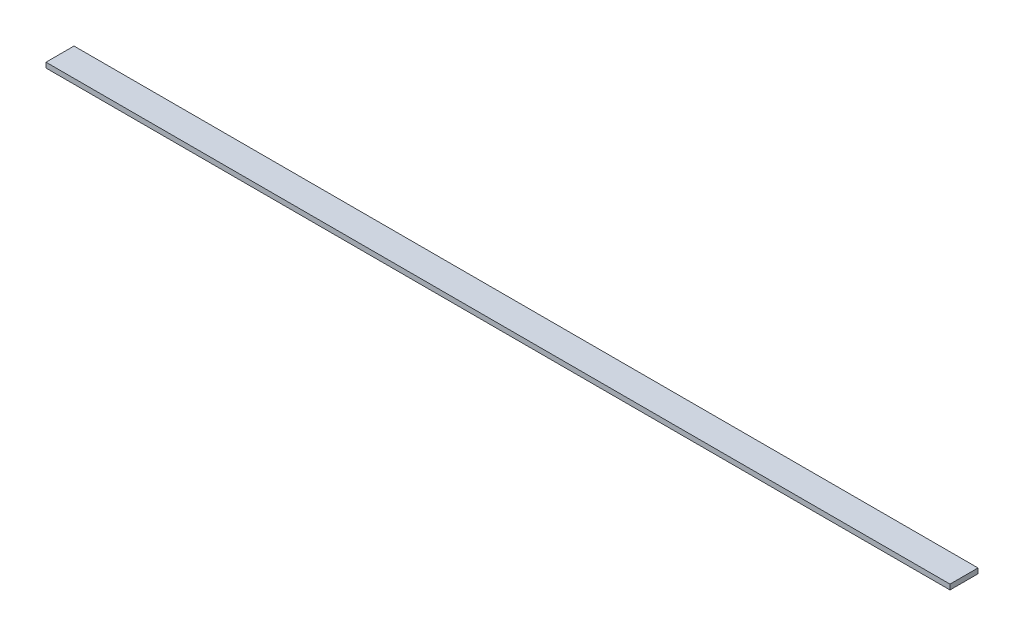
ISO-10303-21;
HEADER;
FILE_DESCRIPTION(('STEP AP214'),'2;1');
FILE_NAME('part.step','',(''),(''),'','','');
FILE_SCHEMA(('AUTOMOTIVE_DESIGN { 1 0 10303 214 1 1 1 1 }'));
ENDSEC;
DATA;
#1=APPLICATION_CONTEXT('core data for automotive mechanical design processes');
#2=APPLICATION_PROTOCOL_DEFINITION('international standard','automotive_design',2000,#1);
#3=PRODUCT_CONTEXT('',#1,'mechanical');
#4=PRODUCT('Part','Part','',(#3));
#5=PRODUCT_RELATED_PRODUCT_CATEGORY('part','',(#4));
#6=PRODUCT_DEFINITION_FORMATION('','',#4);
#7=PRODUCT_DEFINITION_CONTEXT('part definition',#1,'design');
#8=PRODUCT_DEFINITION('design','',#6,#7);
#9=PRODUCT_DEFINITION_SHAPE('','',#8);
#10=(LENGTH_UNIT() NAMED_UNIT(*) SI_UNIT(.MILLI.,.METRE.));
#11=(NAMED_UNIT(*) PLANE_ANGLE_UNIT() SI_UNIT($,.RADIAN.));
#12=(NAMED_UNIT(*) SI_UNIT($,.STERADIAN.) SOLID_ANGLE_UNIT());
#13=UNCERTAINTY_MEASURE_WITH_UNIT(LENGTH_MEASURE(1.E-05),#10,'distance_accuracy_value','');
#14=(GEOMETRIC_REPRESENTATION_CONTEXT(3) GLOBAL_UNCERTAINTY_ASSIGNED_CONTEXT((#13)) GLOBAL_UNIT_ASSIGNED_CONTEXT((#10,
#11,#12)) REPRESENTATION_CONTEXT('',''));
#15=CARTESIAN_POINT('',(0.,0.,0.));
#16=DIRECTION('',(0.,0.,1.));
#17=DIRECTION('',(1.,0.,0.));
#18=AXIS2_PLACEMENT_3D('',#15,#16,#17);
#19=CARTESIAN_POINT('',(0.,25.4,0.));
#20=DIRECTION('',(1.,0.,0.));
#21=DIRECTION('',(0.,0.,-1.));
#22=AXIS2_PLACEMENT_3D('',#19,#20,#21);
#23=PLANE('',#22);
#24=DIRECTION('',(0.,0.,1.));
#25=VECTOR('',#24,1.);
#26=CARTESIAN_POINT('',(0.,0.,0.));
#27=LINE('',#26,#25);
#28=CARTESIAN_POINT('',(0.,0.,-139.7));
#29=VERTEX_POINT('',#28);
#30=CARTESIAN_POINT('',(0.,0.,0.));
#31=VERTEX_POINT('',#30);
#32=EDGE_CURVE('E96',#29,#31,#27,.T.);
#33=ORIENTED_EDGE('',*,*,#32,.T.);
#34=DIRECTION('',(0.,-1.,0.));
#35=VECTOR('',#34,1.);
#36=CARTESIAN_POINT('',(0.,25.4,0.));
#37=LINE('',#36,#35);
#38=CARTESIAN_POINT('',(0.,25.4,0.));
#39=VERTEX_POINT('',#38);
#40=EDGE_CURVE('E11',#39,#31,#37,.T.);
#41=ORIENTED_EDGE('',*,*,#40,.F.);
#42=DIRECTION('',(0.,0.,1.));
#43=VECTOR('',#42,1.);
#44=CARTESIAN_POINT('',(0.,25.4,0.));
#45=LINE('',#44,#43);
#46=CARTESIAN_POINT('',(0.,25.4,-139.7));
#47=VERTEX_POINT('',#46);
#48=EDGE_CURVE('E84',#47,#39,#45,.T.);
#49=ORIENTED_EDGE('',*,*,#48,.F.);
#50=DIRECTION('',(0.,-1.,0.));
#51=VECTOR('',#50,1.);
#52=CARTESIAN_POINT('',(0.,25.4,-139.7));
#53=LINE('',#52,#51);
#54=EDGE_CURVE('E92',#47,#29,#53,.T.);
#55=ORIENTED_EDGE('',*,*,#54,.T.);
#56=EDGE_LOOP('',(#33,#41,#49,#55));
#57=FACE_BOUND('',#56,.T.);
#58=ADVANCED_FACE('F33',(#57),#23,.F.);
#59=CARTESIAN_POINT('',(0.,25.4,0.));
#60=DIRECTION('',(0.,0.,-1.));
#61=DIRECTION('',(-1.,0.,0.));
#62=AXIS2_PLACEMENT_3D('',#59,#60,#61);
#63=PLANE('',#62);
#64=DIRECTION('',(1.,0.,0.));
#65=VECTOR('',#64,1.);
#66=CARTESIAN_POINT('',(0.,0.,0.));
#67=LINE('',#66,#65);
#68=CARTESIAN_POINT('',(4508.5,0.,0.));
#69=VERTEX_POINT('',#68);
#70=EDGE_CURVE('E88',#31,#69,#67,.T.);
#71=ORIENTED_EDGE('',*,*,#70,.T.);
#72=DIRECTION('',(0.,-1.,0.));
#73=VECTOR('',#72,1.);
#74=CARTESIAN_POINT('',(4508.5,25.4,0.));
#75=LINE('',#74,#73);
#76=CARTESIAN_POINT('',(4508.5,25.4,0.));
#77=VERTEX_POINT('',#76);
#78=EDGE_CURVE('E41',#77,#69,#75,.T.);
#79=ORIENTED_EDGE('',*,*,#78,.F.);
#80=DIRECTION('',(1.,0.,0.));
#81=VECTOR('',#80,1.);
#82=CARTESIAN_POINT('',(0.,25.4,0.));
#83=LINE('',#82,#81);
#84=EDGE_CURVE('E79',#39,#77,#83,.T.);
#85=ORIENTED_EDGE('',*,*,#84,.F.);
#86=ORIENTED_EDGE('',*,*,#40,.T.);
#87=EDGE_LOOP('',(#71,#79,#85,#86));
#88=FACE_BOUND('',#87,.T.);
#89=ADVANCED_FACE('F87',(#88),#63,.F.);
#90=CARTESIAN_POINT('',(4508.5,25.4,0.));
#91=DIRECTION('',(-1.,0.,0.));
#92=DIRECTION('',(0.,0.,1.));
#93=AXIS2_PLACEMENT_3D('',#90,#91,#92);
#94=PLANE('',#93);
#95=DIRECTION('',(0.,0.,-1.));
#96=VECTOR('',#95,1.);
#97=CARTESIAN_POINT('',(4508.5,0.,0.));
#98=LINE('',#97,#96);
#99=CARTESIAN_POINT('',(4508.5,0.,-139.7));
#100=VERTEX_POINT('',#99);
#101=EDGE_CURVE('E66',#69,#100,#98,.T.);
#102=ORIENTED_EDGE('',*,*,#101,.T.);
#103=DIRECTION('',(0.,-1.,0.));
#104=VECTOR('',#103,1.);
#105=CARTESIAN_POINT('',(4508.5,25.4,-139.7));
#106=LINE('',#105,#104);
#107=CARTESIAN_POINT('',(4508.5,25.4,-139.7));
#108=VERTEX_POINT('',#107);
#109=EDGE_CURVE('E89',#108,#100,#106,.T.);
#110=ORIENTED_EDGE('',*,*,#109,.F.);
#111=DIRECTION('',(0.,0.,-1.));
#112=VECTOR('',#111,1.);
#113=CARTESIAN_POINT('',(4508.5,25.4,0.));
#114=LINE('',#113,#112);
#115=EDGE_CURVE('E82',#77,#108,#114,.T.);
#116=ORIENTED_EDGE('',*,*,#115,.F.);
#117=ORIENTED_EDGE('',*,*,#78,.T.);
#118=EDGE_LOOP('',(#102,#110,#116,#117));
#119=FACE_BOUND('',#118,.T.);
#120=ADVANCED_FACE('F90',(#119),#94,.F.);
#121=CARTESIAN_POINT('',(0.,25.4,-139.7));
#122=DIRECTION('',(0.,0.,1.));
#123=DIRECTION('',(1.,0.,0.));
#124=AXIS2_PLACEMENT_3D('',#121,#122,#123);
#125=PLANE('',#124);
#126=DIRECTION('',(-1.,0.,0.));
#127=VECTOR('',#126,1.);
#128=CARTESIAN_POINT('',(0.,0.,-139.7));
#129=LINE('',#128,#127);
#130=EDGE_CURVE('E72',#100,#29,#129,.T.);
#131=ORIENTED_EDGE('',*,*,#130,.T.);
#132=ORIENTED_EDGE('',*,*,#54,.F.);
#133=DIRECTION('',(-1.,0.,0.));
#134=VECTOR('',#133,1.);
#135=CARTESIAN_POINT('',(0.,25.4,-139.7));
#136=LINE('',#135,#134);
#137=EDGE_CURVE('E49',#108,#47,#136,.T.);
#138=ORIENTED_EDGE('',*,*,#137,.F.);
#139=ORIENTED_EDGE('',*,*,#109,.T.);
#140=EDGE_LOOP('',(#131,#132,#138,#139));
#141=FACE_BOUND('',#140,.T.);
#142=ADVANCED_FACE('F103',(#141),#125,.F.);
#143=CARTESIAN_POINT('',(0.,25.4,0.));
#144=DIRECTION('',(0.,-1.,0.));
#145=DIRECTION('',(0.,0.,-1.));
#146=AXIS2_PLACEMENT_3D('',#143,#144,#145);
#147=PLANE('',#146);
#148=ORIENTED_EDGE('',*,*,#48,.T.);
#149=ORIENTED_EDGE('',*,*,#84,.T.);
#150=ORIENTED_EDGE('',*,*,#115,.T.);
#151=ORIENTED_EDGE('',*,*,#137,.T.);
#152=EDGE_LOOP('',(#148,#149,#150,#151));
#153=FACE_BOUND('',#152,.T.);
#154=ADVANCED_FACE('F80',(#153),#147,.F.);
#155=CARTESIAN_POINT('',(0.,0.,0.));
#156=DIRECTION('',(0.,-1.,0.));
#157=DIRECTION('',(0.,0.,-1.));
#158=AXIS2_PLACEMENT_3D('',#155,#156,#157);
#159=PLANE('',#158);
#160=ORIENTED_EDGE('',*,*,#32,.F.);
#161=ORIENTED_EDGE('',*,*,#130,.F.);
#162=ORIENTED_EDGE('',*,*,#101,.F.);
#163=ORIENTED_EDGE('',*,*,#70,.F.);
#164=EDGE_LOOP('',(#160,#161,#162,#163));
#165=FACE_BOUND('',#164,.T.);
#166=ADVANCED_FACE('F106',(#165),#159,.T.);
#167=CLOSED_SHELL('',(#58,#89,#120,#142,#154,#166));
#168=MANIFOLD_SOLID_BREP('B2',#167);
#169=ADVANCED_BREP_SHAPE_REPRESENTATION('',(#18,#168),#14);
#170=SHAPE_DEFINITION_REPRESENTATION(#9,#169);
ENDSEC;
END-ISO-10303-21;
